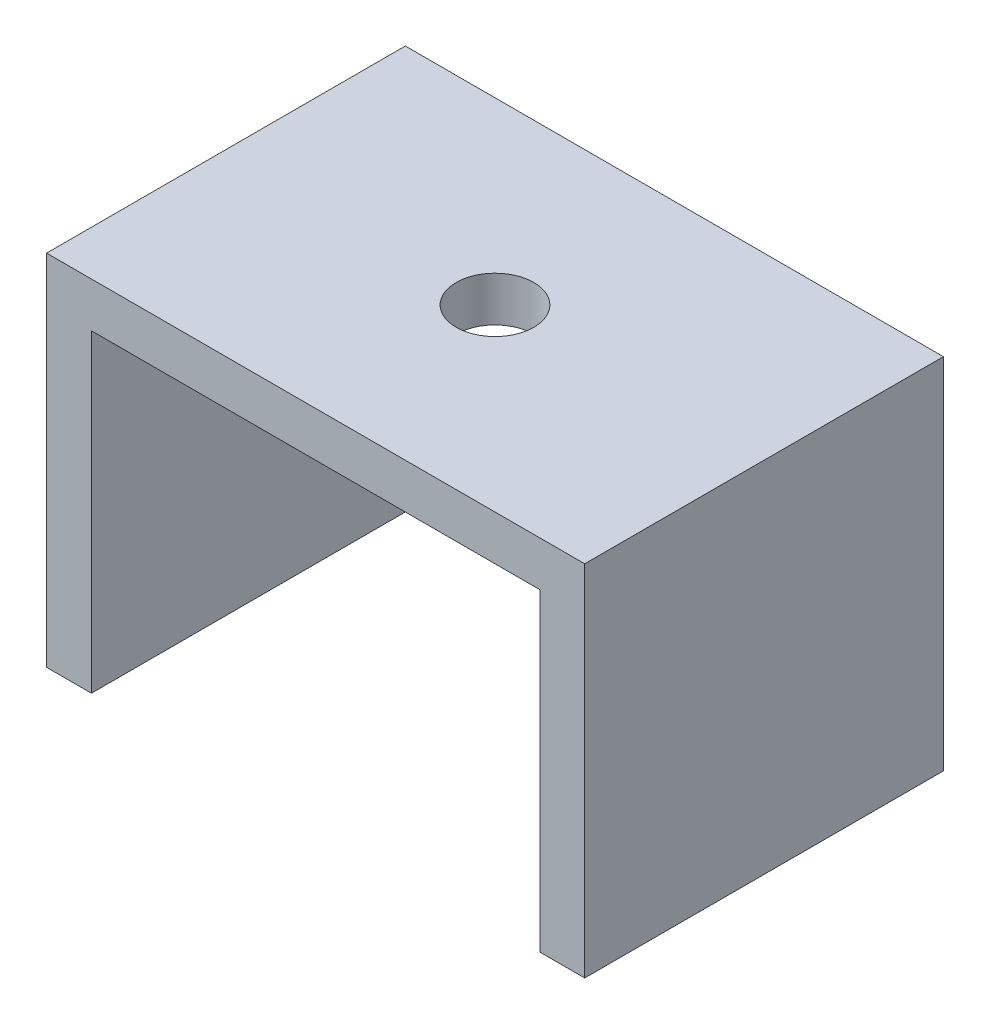
ISO-10303-21;
HEADER;
FILE_DESCRIPTION(('STEP AP214'),'2;1');
FILE_NAME('part.step','',(''),(''),'','','');
FILE_SCHEMA(('AUTOMOTIVE_DESIGN { 1 0 10303 214 1 1 1 1 }'));
ENDSEC;
DATA;
#1=APPLICATION_CONTEXT('core data for automotive mechanical design processes');
#2=APPLICATION_PROTOCOL_DEFINITION('international standard','automotive_design',2000,#1);
#3=PRODUCT_CONTEXT('',#1,'mechanical');
#4=PRODUCT('Part','Part','',(#3));
#5=PRODUCT_RELATED_PRODUCT_CATEGORY('part','',(#4));
#6=PRODUCT_DEFINITION_FORMATION('','',#4);
#7=PRODUCT_DEFINITION_CONTEXT('part definition',#1,'design');
#8=PRODUCT_DEFINITION('design','',#6,#7);
#9=PRODUCT_DEFINITION_SHAPE('','',#8);
#10=(LENGTH_UNIT() NAMED_UNIT(*) SI_UNIT(.MILLI.,.METRE.));
#11=(NAMED_UNIT(*) PLANE_ANGLE_UNIT() SI_UNIT($,.RADIAN.));
#12=(NAMED_UNIT(*) SI_UNIT($,.STERADIAN.) SOLID_ANGLE_UNIT());
#13=UNCERTAINTY_MEASURE_WITH_UNIT(LENGTH_MEASURE(1.E-05),#10,'distance_accuracy_value','');
#14=(GEOMETRIC_REPRESENTATION_CONTEXT(3) GLOBAL_UNCERTAINTY_ASSIGNED_CONTEXT((#13)) GLOBAL_UNIT_ASSIGNED_CONTEXT((#10,
#11,#12)) REPRESENTATION_CONTEXT('',''));
#15=CARTESIAN_POINT('',(0.,0.,0.));
#16=DIRECTION('',(0.,0.,1.));
#17=DIRECTION('',(1.,0.,0.));
#18=AXIS2_PLACEMENT_3D('',#15,#16,#17);
#19=CARTESIAN_POINT('',(-38.1,6.35,50.8));
#20=DIRECTION('',(1.,0.,0.));
#21=DIRECTION('',(0.,1.,0.));
#22=AXIS2_PLACEMENT_3D('',#19,#20,#21);
#23=PLANE('',#22);
#24=DIRECTION('',(0.,-1.,0.));
#25=VECTOR('',#24,1.);
#26=CARTESIAN_POINT('',(-38.1,6.35,0.));
#27=LINE('',#26,#25);
#28=CARTESIAN_POINT('',(-38.1,6.35,0.));
#29=VERTEX_POINT('',#28);
#30=CARTESIAN_POINT('',(-38.1,-44.45,0.));
#31=VERTEX_POINT('',#30);
#32=EDGE_CURVE('E128',#29,#31,#27,.T.);
#33=ORIENTED_EDGE('',*,*,#32,.T.);
#34=DIRECTION('',(0.,0.,-1.));
#35=VECTOR('',#34,1.);
#36=CARTESIAN_POINT('',(-38.1,-44.45,50.8));
#37=LINE('',#36,#35);
#38=CARTESIAN_POINT('',(-38.1,-44.45,50.8));
#39=VERTEX_POINT('',#38);
#40=EDGE_CURVE('E11',#39,#31,#37,.T.);
#41=ORIENTED_EDGE('',*,*,#40,.F.);
#42=DIRECTION('',(0.,-1.,0.));
#43=VECTOR('',#42,1.);
#44=CARTESIAN_POINT('',(-38.1,6.35,50.8));
#45=LINE('',#44,#43);
#46=CARTESIAN_POINT('',(-38.1,6.35,50.8));
#47=VERTEX_POINT('',#46);
#48=EDGE_CURVE('E143',#47,#39,#45,.T.);
#49=ORIENTED_EDGE('',*,*,#48,.F.);
#50=DIRECTION('',(0.,0.,-1.));
#51=VECTOR('',#50,1.);
#52=CARTESIAN_POINT('',(-38.1,6.35,50.8));
#53=LINE('',#52,#51);
#54=EDGE_CURVE('E124',#47,#29,#53,.T.);
#55=ORIENTED_EDGE('',*,*,#54,.T.);
#56=EDGE_LOOP('',(#33,#41,#49,#55));
#57=FACE_BOUND('',#56,.T.);
#58=ADVANCED_FACE('F32',(#57),#23,.F.);
#59=CARTESIAN_POINT('',(-38.1,-44.45,50.8));
#60=DIRECTION('',(0.,1.,0.));
#61=DIRECTION('',(0.,0.,1.));
#62=AXIS2_PLACEMENT_3D('',#59,#60,#61);
#63=PLANE('',#62);
#64=DIRECTION('',(1.,0.,0.));
#65=VECTOR('',#64,1.);
#66=CARTESIAN_POINT('',(-38.1,-44.45,0.));
#67=LINE('',#66,#65);
#68=CARTESIAN_POINT('',(-31.75,-44.45,0.));
#69=VERTEX_POINT('',#68);
#70=EDGE_CURVE('E131',#31,#69,#67,.T.);
#71=ORIENTED_EDGE('',*,*,#70,.T.);
#72=DIRECTION('',(0.,0.,-1.));
#73=VECTOR('',#72,1.);
#74=CARTESIAN_POINT('',(-31.75,-44.45,50.8));
#75=LINE('',#74,#73);
#76=CARTESIAN_POINT('',(-31.75,-44.45,50.8));
#77=VERTEX_POINT('',#76);
#78=EDGE_CURVE('E40',#77,#69,#75,.T.);
#79=ORIENTED_EDGE('',*,*,#78,.F.);
#80=DIRECTION('',(1.,0.,0.));
#81=VECTOR('',#80,1.);
#82=CARTESIAN_POINT('',(-38.1,-44.45,50.8));
#83=LINE('',#82,#81);
#84=EDGE_CURVE('E91',#39,#77,#83,.T.);
#85=ORIENTED_EDGE('',*,*,#84,.F.);
#86=ORIENTED_EDGE('',*,*,#40,.T.);
#87=EDGE_LOOP('',(#71,#79,#85,#86));
#88=FACE_BOUND('',#87,.T.);
#89=ADVANCED_FACE('F196',(#88),#63,.F.);
#90=CARTESIAN_POINT('',(-31.75,-44.45,50.8));
#91=DIRECTION('',(-1.,0.,0.));
#92=DIRECTION('',(0.,0.,1.));
#93=AXIS2_PLACEMENT_3D('',#90,#91,#92);
#94=PLANE('',#93);
#95=DIRECTION('',(0.,1.,0.));
#96=VECTOR('',#95,1.);
#97=CARTESIAN_POINT('',(-31.75,-44.45,0.));
#98=LINE('',#97,#96);
#99=CARTESIAN_POINT('',(-31.75,0.,0.));
#100=VERTEX_POINT('',#99);
#101=EDGE_CURVE('E134',#69,#100,#98,.T.);
#102=ORIENTED_EDGE('',*,*,#101,.T.);
#103=DIRECTION('',(0.,0.,-1.));
#104=VECTOR('',#103,1.);
#105=CARTESIAN_POINT('',(-31.75,0.,50.8));
#106=LINE('',#105,#104);
#107=CARTESIAN_POINT('',(-31.75,0.,50.8));
#108=VERTEX_POINT('',#107);
#109=EDGE_CURVE('E150',#108,#100,#106,.T.);
#110=ORIENTED_EDGE('',*,*,#109,.F.);
#111=DIRECTION('',(0.,1.,0.));
#112=VECTOR('',#111,1.);
#113=CARTESIAN_POINT('',(-31.75,-44.45,50.8));
#114=LINE('',#113,#112);
#115=EDGE_CURVE('E158',#77,#108,#114,.T.);
#116=ORIENTED_EDGE('',*,*,#115,.F.);
#117=ORIENTED_EDGE('',*,*,#78,.T.);
#118=EDGE_LOOP('',(#102,#110,#116,#117));
#119=FACE_BOUND('',#118,.T.);
#120=ADVANCED_FACE('F156',(#119),#94,.F.);
#121=CARTESIAN_POINT('',(-31.75,0.,50.8));
#122=DIRECTION('',(0.,1.,0.));
#123=DIRECTION('',(0.,0.,1.));
#124=AXIS2_PLACEMENT_3D('',#121,#122,#123);
#125=PLANE('',#124);
#126=CARTESIAN_POINT('',(0.,0.,25.4));
#127=DIRECTION('',(0.,1.,0.));
#128=DIRECTION('',(0.,0.,1.));
#129=AXIS2_PLACEMENT_3D('',#126,#127,#128);
#130=CIRCLE('',#129,5.5);
#131=CARTESIAN_POINT('',(0.,0.,30.9));
#132=VERTEX_POINT('',#131);
#133=EDGE_CURVE('E132',#132,#132,#130,.T.);
#134=ORIENTED_EDGE('',*,*,#133,.T.);
#135=EDGE_LOOP('',(#134));
#136=FACE_BOUND('',#135,.T.);
#137=DIRECTION('',(1.,0.,0.));
#138=VECTOR('',#137,1.);
#139=CARTESIAN_POINT('',(-31.75,0.,0.));
#140=LINE('',#139,#138);
#141=CARTESIAN_POINT('',(31.75,0.,0.));
#142=VERTEX_POINT('',#141);
#143=EDGE_CURVE('E136',#100,#142,#140,.T.);
#144=ORIENTED_EDGE('',*,*,#143,.T.);
#145=DIRECTION('',(0.,0.,-1.));
#146=VECTOR('',#145,1.);
#147=CARTESIAN_POINT('',(31.75,0.,50.8));
#148=LINE('',#147,#146);
#149=CARTESIAN_POINT('',(31.75,0.,50.8));
#150=VERTEX_POINT('',#149);
#151=EDGE_CURVE('E147',#150,#142,#148,.T.);
#152=ORIENTED_EDGE('',*,*,#151,.F.);
#153=DIRECTION('',(1.,0.,0.));
#154=VECTOR('',#153,1.);
#155=CARTESIAN_POINT('',(-31.75,0.,50.8));
#156=LINE('',#155,#154);
#157=EDGE_CURVE('E170',#108,#150,#156,.T.);
#158=ORIENTED_EDGE('',*,*,#157,.F.);
#159=ORIENTED_EDGE('',*,*,#109,.T.);
#160=EDGE_LOOP('',(#144,#152,#158,#159));
#161=FACE_BOUND('',#160,.T.);
#162=ADVANCED_FACE('F166',(#136,#161),#125,.F.);
#163=CARTESIAN_POINT('',(31.75,-44.45,50.8));
#164=DIRECTION('',(1.,0.,0.));
#165=DIRECTION('',(0.,0.,-1.));
#166=AXIS2_PLACEMENT_3D('',#163,#164,#165);
#167=PLANE('',#166);
#168=DIRECTION('',(0.,-1.,0.));
#169=VECTOR('',#168,1.);
#170=CARTESIAN_POINT('',(31.75,-44.45,0.));
#171=LINE('',#170,#169);
#172=CARTESIAN_POINT('',(31.75,-44.45,0.));
#173=VERTEX_POINT('',#172);
#174=EDGE_CURVE('E138',#142,#173,#171,.T.);
#175=ORIENTED_EDGE('',*,*,#174,.T.);
#176=DIRECTION('',(0.,0.,-1.));
#177=VECTOR('',#176,1.);
#178=CARTESIAN_POINT('',(31.75,-44.45,50.8));
#179=LINE('',#178,#177);
#180=CARTESIAN_POINT('',(31.75,-44.45,50.8));
#181=VERTEX_POINT('',#180);
#182=EDGE_CURVE('E119',#181,#173,#179,.T.);
#183=ORIENTED_EDGE('',*,*,#182,.F.);
#184=DIRECTION('',(0.,-1.,0.));
#185=VECTOR('',#184,1.);
#186=CARTESIAN_POINT('',(31.75,-44.45,50.8));
#187=LINE('',#186,#185);
#188=EDGE_CURVE('E110',#150,#181,#187,.T.);
#189=ORIENTED_EDGE('',*,*,#188,.F.);
#190=ORIENTED_EDGE('',*,*,#151,.T.);
#191=EDGE_LOOP('',(#175,#183,#189,#190));
#192=FACE_BOUND('',#191,.T.);
#193=ADVANCED_FACE('F169',(#192),#167,.F.);
#194=CARTESIAN_POINT('',(38.1,-44.45,50.8));
#195=DIRECTION('',(0.,1.,0.));
#196=DIRECTION('',(0.,0.,1.));
#197=AXIS2_PLACEMENT_3D('',#194,#195,#196);
#198=PLANE('',#197);
#199=DIRECTION('',(1.,0.,0.));
#200=VECTOR('',#199,1.);
#201=CARTESIAN_POINT('',(38.1,-44.45,0.));
#202=LINE('',#201,#200);
#203=CARTESIAN_POINT('',(38.1,-44.45,0.));
#204=VERTEX_POINT('',#203);
#205=EDGE_CURVE('E118',#173,#204,#202,.T.);
#206=ORIENTED_EDGE('',*,*,#205,.T.);
#207=DIRECTION('',(0.,0.,-1.));
#208=VECTOR('',#207,1.);
#209=CARTESIAN_POINT('',(38.1,-44.45,50.8));
#210=LINE('',#209,#208);
#211=CARTESIAN_POINT('',(38.1,-44.45,50.8));
#212=VERTEX_POINT('',#211);
#213=EDGE_CURVE('E115',#212,#204,#210,.T.);
#214=ORIENTED_EDGE('',*,*,#213,.F.);
#215=DIRECTION('',(1.,0.,0.));
#216=VECTOR('',#215,1.);
#217=CARTESIAN_POINT('',(38.1,-44.45,50.8));
#218=LINE('',#217,#216);
#219=EDGE_CURVE('E104',#181,#212,#218,.T.);
#220=ORIENTED_EDGE('',*,*,#219,.F.);
#221=ORIENTED_EDGE('',*,*,#182,.T.);
#222=EDGE_LOOP('',(#206,#214,#220,#221));
#223=FACE_BOUND('',#222,.T.);
#224=ADVANCED_FACE('F116',(#223),#198,.F.);
#225=CARTESIAN_POINT('',(38.1,6.35,50.8));
#226=DIRECTION('',(-1.,0.,0.));
#227=DIRECTION('',(0.,-1.,0.));
#228=AXIS2_PLACEMENT_3D('',#225,#226,#227);
#229=PLANE('',#228);
#230=DIRECTION('',(0.,1.,0.));
#231=VECTOR('',#230,1.);
#232=CARTESIAN_POINT('',(38.1,6.35,0.));
#233=LINE('',#232,#231);
#234=CARTESIAN_POINT('',(38.1,6.35,0.));
#235=VERTEX_POINT('',#234);
#236=EDGE_CURVE('E77',#204,#235,#233,.T.);
#237=ORIENTED_EDGE('',*,*,#236,.T.);
#238=DIRECTION('',(0.,0.,-1.));
#239=VECTOR('',#238,1.);
#240=CARTESIAN_POINT('',(38.1,6.35,50.8));
#241=LINE('',#240,#239);
#242=CARTESIAN_POINT('',(38.1,6.35,50.8));
#243=VERTEX_POINT('',#242);
#244=EDGE_CURVE('E120',#243,#235,#241,.T.);
#245=ORIENTED_EDGE('',*,*,#244,.F.);
#246=DIRECTION('',(0.,1.,0.));
#247=VECTOR('',#246,1.);
#248=CARTESIAN_POINT('',(38.1,6.35,50.8));
#249=LINE('',#248,#247);
#250=EDGE_CURVE('E108',#212,#243,#249,.T.);
#251=ORIENTED_EDGE('',*,*,#250,.F.);
#252=ORIENTED_EDGE('',*,*,#213,.T.);
#253=EDGE_LOOP('',(#237,#245,#251,#252));
#254=FACE_BOUND('',#253,.T.);
#255=ADVANCED_FACE('F122',(#254),#229,.F.);
#256=CARTESIAN_POINT('',(38.1,6.35,50.8));
#257=DIRECTION('',(0.,-1.,0.));
#258=DIRECTION('',(0.,0.,-1.));
#259=AXIS2_PLACEMENT_3D('',#256,#257,#258);
#260=PLANE('',#259);
#261=CARTESIAN_POINT('',(0.,6.35,25.4));
#262=DIRECTION('',(0.,1.,0.));
#263=DIRECTION('',(0.,0.,1.));
#264=AXIS2_PLACEMENT_3D('',#261,#262,#263);
#265=CIRCLE('',#264,5.5);
#266=CARTESIAN_POINT('',(0.,6.35,30.9));
#267=VERTEX_POINT('',#266);
#268=EDGE_CURVE('E178',#267,#267,#265,.T.);
#269=ORIENTED_EDGE('',*,*,#268,.F.);
#270=EDGE_LOOP('',(#269));
#271=FACE_BOUND('',#270,.T.);
#272=DIRECTION('',(-1.,0.,0.));
#273=VECTOR('',#272,1.);
#274=CARTESIAN_POINT('',(38.1,6.35,0.));
#275=LINE('',#274,#273);
#276=EDGE_CURVE('E83',#235,#29,#275,.T.);
#277=ORIENTED_EDGE('',*,*,#276,.T.);
#278=ORIENTED_EDGE('',*,*,#54,.F.);
#279=DIRECTION('',(-1.,0.,0.));
#280=VECTOR('',#279,1.);
#281=CARTESIAN_POINT('',(38.1,6.35,50.8));
#282=LINE('',#281,#280);
#283=EDGE_CURVE('E48',#243,#47,#282,.T.);
#284=ORIENTED_EDGE('',*,*,#283,.F.);
#285=ORIENTED_EDGE('',*,*,#244,.T.);
#286=EDGE_LOOP('',(#277,#278,#284,#285));
#287=FACE_BOUND('',#286,.T.);
#288=ADVANCED_FACE('F185',(#271,#287),#260,.F.);
#289=CARTESIAN_POINT('',(0.,0.,50.8));
#290=DIRECTION('',(0.,0.,1.));
#291=DIRECTION('',(1.,0.,0.));
#292=AXIS2_PLACEMENT_3D('',#289,#290,#291);
#293=PLANE('',#292);
#294=ORIENTED_EDGE('',*,*,#48,.T.);
#295=ORIENTED_EDGE('',*,*,#84,.T.);
#296=ORIENTED_EDGE('',*,*,#115,.T.);
#297=ORIENTED_EDGE('',*,*,#157,.T.);
#298=ORIENTED_EDGE('',*,*,#188,.T.);
#299=ORIENTED_EDGE('',*,*,#219,.T.);
#300=ORIENTED_EDGE('',*,*,#250,.T.);
#301=ORIENTED_EDGE('',*,*,#283,.T.);
#302=EDGE_LOOP('',(#294,#295,#296,#297,#298,#299,#300,#301));
#303=FACE_BOUND('',#302,.T.);
#304=ADVANCED_FACE('F106',(#303),#293,.T.);
#305=CARTESIAN_POINT('',(0.,0.,0.));
#306=DIRECTION('',(0.,0.,1.));
#307=DIRECTION('',(1.,0.,0.));
#308=AXIS2_PLACEMENT_3D('',#305,#306,#307);
#309=PLANE('',#308);
#310=ORIENTED_EDGE('',*,*,#32,.F.);
#311=ORIENTED_EDGE('',*,*,#276,.F.);
#312=ORIENTED_EDGE('',*,*,#236,.F.);
#313=ORIENTED_EDGE('',*,*,#205,.F.);
#314=ORIENTED_EDGE('',*,*,#174,.F.);
#315=ORIENTED_EDGE('',*,*,#143,.F.);
#316=ORIENTED_EDGE('',*,*,#101,.F.);
#317=ORIENTED_EDGE('',*,*,#70,.F.);
#318=EDGE_LOOP('',(#310,#311,#312,#313,#314,#315,#316,#317));
#319=FACE_BOUND('',#318,.T.);
#320=ADVANCED_FACE('F162',(#319),#309,.F.);
#321=CARTESIAN_POINT('',(0.,-44.45,25.4));
#322=DIRECTION('',(0.,1.,0.));
#323=DIRECTION('',(0.,0.,1.));
#324=AXIS2_PLACEMENT_3D('',#321,#322,#323);
#325=CYLINDRICAL_SURFACE('',#324,5.5);
#326=ORIENTED_EDGE('',*,*,#268,.T.);
#327=EDGE_LOOP('',(#326));
#328=FACE_BOUND('',#327,.T.);
#329=ORIENTED_EDGE('',*,*,#133,.F.);
#330=EDGE_LOOP('',(#329));
#331=FACE_BOUND('',#330,.T.);
#332=ADVANCED_FACE('F182',(#328,#331),#325,.F.);
#333=CLOSED_SHELL('',(#58,#89,#120,#162,#193,#224,#255,#288,#304,#320,#332));
#334=MANIFOLD_SOLID_BREP('B2',#333);
#335=ADVANCED_BREP_SHAPE_REPRESENTATION('',(#18,#334),#14);
#336=SHAPE_DEFINITION_REPRESENTATION(#9,#335);
ENDSEC;
END-ISO-10303-21;
